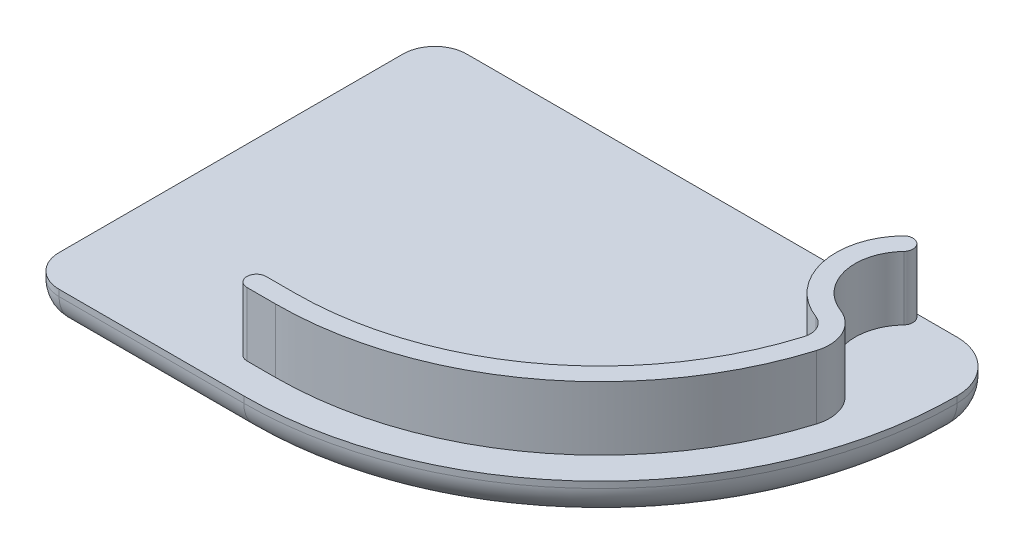
ISO-10303-21;
HEADER;
FILE_DESCRIPTION(('STEP AP214'),'2;1');
FILE_NAME('part.step','',(''),(''),'','','');
FILE_SCHEMA(('AUTOMOTIVE_DESIGN { 1 0 10303 214 1 1 1 1 }'));
ENDSEC;
DATA;
#1=APPLICATION_CONTEXT('core data for automotive mechanical design processes');
#2=APPLICATION_PROTOCOL_DEFINITION('international standard','automotive_design',2000,#1);
#3=PRODUCT_CONTEXT('',#1,'mechanical');
#4=PRODUCT('Part','Part','',(#3));
#5=PRODUCT_RELATED_PRODUCT_CATEGORY('part','',(#4));
#6=PRODUCT_DEFINITION_FORMATION('','',#4);
#7=PRODUCT_DEFINITION_CONTEXT('part definition',#1,'design');
#8=PRODUCT_DEFINITION('design','',#6,#7);
#9=PRODUCT_DEFINITION_SHAPE('','',#8);
#10=(LENGTH_UNIT() NAMED_UNIT(*) SI_UNIT(.MILLI.,.METRE.));
#11=(NAMED_UNIT(*) PLANE_ANGLE_UNIT() SI_UNIT($,.RADIAN.));
#12=(NAMED_UNIT(*) SI_UNIT($,.STERADIAN.) SOLID_ANGLE_UNIT());
#13=UNCERTAINTY_MEASURE_WITH_UNIT(LENGTH_MEASURE(1.E-05),#10,'distance_accuracy_value','');
#14=(GEOMETRIC_REPRESENTATION_CONTEXT(3) GLOBAL_UNCERTAINTY_ASSIGNED_CONTEXT((#13)) GLOBAL_UNIT_ASSIGNED_CONTEXT((#10,
#11,#12)) REPRESENTATION_CONTEXT('',''));
#15=CARTESIAN_POINT('',(0.,0.,0.));
#16=DIRECTION('',(0.,0.,1.));
#17=DIRECTION('',(1.,0.,0.));
#18=AXIS2_PLACEMENT_3D('',#15,#16,#17);
#19=CARTESIAN_POINT('',(40.9999973497516,-2.99999999999999,4.00000043020666));
#20=DIRECTION('',(0.,1.,0.));
#21=DIRECTION('',(0.,0.,1.));
#22=AXIS2_PLACEMENT_3D('',#19,#20,#21);
#23=CYLINDRICAL_SURFACE('',#22,4.00000074290213);
#24=CARTESIAN_POINT('',(40.9999973497516,0.,4.00000043020666));
#25=DIRECTION('',(0.,1.,0.));
#26=DIRECTION('',(0.,0.,1.));
#27=AXIS2_PLACEMENT_3D('',#24,#25,#26);
#28=CIRCLE('',#27,4.00000074290213);
#29=CARTESIAN_POINT('',(44.9999980926524,0.,3.99999813701283));
#30=VERTEX_POINT('',#29);
#31=CARTESIAN_POINT('',(41.0015789831232,0.,0.));
#32=VERTEX_POINT('',#31);
#33=EDGE_CURVE('E358',#30,#32,#28,.T.);
#34=ORIENTED_EDGE('',*,*,#33,.F.);
#35=DIRECTION('',(0.,1.,0.));
#36=VECTOR('',#35,1.);
#37=CARTESIAN_POINT('',(44.999998092651,-2.99999999999999,3.99999577211788));
#38=LINE('',#37,#36);
#39=CARTESIAN_POINT('',(44.9999980926516,-0.499999999999989,3.99999649994411));
#40=VERTEX_POINT('',#39);
#41=EDGE_CURVE('E271',#30,#40,#38,.F.);
#42=ORIENTED_EDGE('',*,*,#41,.T.);
#43=CARTESIAN_POINT('',(40.9999973497516,-0.49999999999999,4.00000043020666));
#44=DIRECTION('',(0.,1.,0.));
#45=DIRECTION('',(0.,0.,1.));
#46=AXIS2_PLACEMENT_3D('',#43,#44,#45);
#47=CIRCLE('',#46,4.00000074290213);
#48=CARTESIAN_POINT('',(41.0015789831232,-0.49999999999999,0.));
#49=VERTEX_POINT('',#48);
#50=EDGE_CURVE('E263',#40,#49,#47,.T.);
#51=ORIENTED_EDGE('',*,*,#50,.T.);
#52=DIRECTION('',(0.,1.,0.));
#53=VECTOR('',#52,1.);
#54=CARTESIAN_POINT('',(41.0015789831232,-2.99999999999999,0.));
#55=LINE('',#54,#53);
#56=EDGE_CURVE('E270',#49,#32,#55,.T.);
#57=ORIENTED_EDGE('',*,*,#56,.T.);
#58=EDGE_LOOP('',(#34,#42,#51,#57));
#59=FACE_BOUND('',#58,.T.);
#60=ADVANCED_FACE('F16',(#59),#23,.T.);
#61=CARTESIAN_POINT('',(17.,-3.,3.99999999999998));
#62=DIRECTION('',(0.,1.,0.));
#63=DIRECTION('',(0.,0.,1.));
#64=AXIS2_PLACEMENT_3D('',#61,#62,#63);
#65=CYLINDRICAL_SURFACE('',#64,27.9999980926514);
#66=CARTESIAN_POINT('',(17.,0.,3.99999999999998));
#67=DIRECTION('',(0.,1.,0.));
#68=DIRECTION('',(0.,0.,1.));
#69=AXIS2_PLACEMENT_3D('',#66,#67,#68);
#70=CIRCLE('',#69,27.9999980926514);
#71=CARTESIAN_POINT('',(17.,0.,31.9999980926514));
#72=VERTEX_POINT('',#71);
#73=EDGE_CURVE('E361',#72,#30,#70,.T.);
#74=ORIENTED_EDGE('',*,*,#73,.F.);
#75=DIRECTION('',(0.,1.,0.));
#76=VECTOR('',#75,1.);
#77=CARTESIAN_POINT('',(17.,-2.99999999999999,31.9999980926514));
#78=LINE('',#77,#76);
#79=CARTESIAN_POINT('',(17.,-0.499999999999989,31.9999980926514));
#80=VERTEX_POINT('',#79);
#81=EDGE_CURVE('E276',#72,#80,#78,.F.);
#82=ORIENTED_EDGE('',*,*,#81,.T.);
#83=CARTESIAN_POINT('',(17.,-0.499999999999995,3.99999999999998));
#84=DIRECTION('',(0.,1.,0.));
#85=DIRECTION('',(0.,0.,1.));
#86=AXIS2_PLACEMENT_3D('',#83,#84,#85);
#87=CIRCLE('',#86,27.9999980926514);
#88=EDGE_CURVE('E272',#80,#40,#87,.T.);
#89=ORIENTED_EDGE('',*,*,#88,.T.);
#90=ORIENTED_EDGE('',*,*,#41,.F.);
#91=EDGE_LOOP('',(#74,#82,#89,#90));
#92=FACE_BOUND('',#91,.T.);
#93=ADVANCED_FACE('F454',(#92),#65,.T.);
#94=CARTESIAN_POINT('',(17.,-2.99999999999999,31.9999980926514));
#95=DIRECTION('',(0.,0.,1.));
#96=DIRECTION('',(1.,0.,0.));
#97=AXIS2_PLACEMENT_3D('',#94,#95,#96);
#98=PLANE('',#97);
#99=CARTESIAN_POINT('',(2.49999999999999,0.,31.9999980926514));
#100=CARTESIAN_POINT('',(17.,0.,31.9999980926514));
#101=B_SPLINE_CURVE_WITH_KNOTS('',1,(#99,#100),.UNSPECIFIED.,.F.,.F.,(2,2),(0.,1.),.UNSPECIFIED.);
#102=CARTESIAN_POINT('',(2.49999999999999,0.,31.9999980926514));
#103=VERTEX_POINT('',#102);
#104=EDGE_CURVE('E364',#103,#72,#101,.T.);
#105=ORIENTED_EDGE('',*,*,#104,.F.);
#106=DIRECTION('',(0.,1.,0.));
#107=VECTOR('',#106,1.);
#108=CARTESIAN_POINT('',(2.49999999999999,-2.99999999999999,31.9999980926514));
#109=LINE('',#108,#107);
#110=CARTESIAN_POINT('',(2.49999999999999,-0.499999999999991,31.9999980926514));
#111=VERTEX_POINT('',#110);
#112=EDGE_CURVE('E275',#103,#111,#109,.F.);
#113=ORIENTED_EDGE('',*,*,#112,.T.);
#114=DIRECTION('',(1.,0.,0.));
#115=VECTOR('',#114,1.);
#116=CARTESIAN_POINT('',(17.,-0.499999999999991,31.9999980926514));
#117=LINE('',#116,#115);
#118=EDGE_CURVE('E277',#111,#80,#117,.T.);
#119=ORIENTED_EDGE('',*,*,#118,.T.);
#120=ORIENTED_EDGE('',*,*,#81,.F.);
#121=EDGE_LOOP('',(#105,#113,#119,#120));
#122=FACE_BOUND('',#121,.T.);
#123=ADVANCED_FACE('F458',(#122),#98,.T.);
#124=CARTESIAN_POINT('',(2.49999999999999,-2.99999999999999,29.4999980926514));
#125=DIRECTION('',(0.,1.,0.));
#126=DIRECTION('',(0.,0.,1.));
#127=AXIS2_PLACEMENT_3D('',#124,#125,#126);
#128=CYLINDRICAL_SURFACE('',#127,2.5);
#129=CARTESIAN_POINT('',(2.49999999999998,0.,29.4999980926514));
#130=DIRECTION('',(0.,1.,0.));
#131=DIRECTION('',(0.,0.,1.));
#132=AXIS2_PLACEMENT_3D('',#129,#130,#131);
#133=CIRCLE('',#132,2.5);
#134=CARTESIAN_POINT('',(0.,0.,29.4999980926514));
#135=VERTEX_POINT('',#134);
#136=EDGE_CURVE('E365',#135,#103,#133,.T.);
#137=ORIENTED_EDGE('',*,*,#136,.F.);
#138=DIRECTION('',(0.,1.,0.));
#139=VECTOR('',#138,1.);
#140=CARTESIAN_POINT('',(0.,-2.99999999999999,29.4999980926514));
#141=LINE('',#140,#139);
#142=CARTESIAN_POINT('',(0.,-0.499999999999994,29.4999980926514));
#143=VERTEX_POINT('',#142);
#144=EDGE_CURVE('E280',#135,#143,#141,.F.);
#145=ORIENTED_EDGE('',*,*,#144,.T.);
#146=CARTESIAN_POINT('',(2.49999999999999,-0.499999999999991,29.4999980926514));
#147=DIRECTION('',(0.,1.,0.));
#148=DIRECTION('',(0.,0.,1.));
#149=AXIS2_PLACEMENT_3D('',#146,#147,#148);
#150=CIRCLE('',#149,2.5);
#151=EDGE_CURVE('E281',#143,#111,#150,.T.);
#152=ORIENTED_EDGE('',*,*,#151,.T.);
#153=ORIENTED_EDGE('',*,*,#112,.F.);
#154=EDGE_LOOP('',(#137,#145,#152,#153));
#155=FACE_BOUND('',#154,.T.);
#156=ADVANCED_FACE('F463',(#155),#128,.T.);
#157=CARTESIAN_POINT('',(0.,-2.99999999999999,29.4999980926514));
#158=DIRECTION('',(-1.,0.,0.));
#159=DIRECTION('',(0.,0.,1.));
#160=AXIS2_PLACEMENT_3D('',#157,#158,#159);
#161=PLANE('',#160);
#162=CARTESIAN_POINT('',(0.,0.,2.5));
#163=CARTESIAN_POINT('',(0.,0.,29.4999980926514));
#164=B_SPLINE_CURVE_WITH_KNOTS('',1,(#162,#163),.UNSPECIFIED.,.F.,.F.,(2,2),(0.,1.),.UNSPECIFIED.);
#165=CARTESIAN_POINT('',(0.,0.,2.49999999999999));
#166=VERTEX_POINT('',#165);
#167=EDGE_CURVE('E368',#166,#135,#164,.T.);
#168=ORIENTED_EDGE('',*,*,#167,.F.);
#169=DIRECTION('',(0.,1.,0.));
#170=VECTOR('',#169,1.);
#171=CARTESIAN_POINT('',(0.,-2.99999999999999,2.49999999999999));
#172=LINE('',#171,#170);
#173=CARTESIAN_POINT('',(0.,-0.499999999999999,2.49999999999999));
#174=VERTEX_POINT('',#173);
#175=EDGE_CURVE('E284',#166,#174,#172,.F.);
#176=ORIENTED_EDGE('',*,*,#175,.T.);
#177=DIRECTION('',(0.,0.,1.));
#178=VECTOR('',#177,1.);
#179=CARTESIAN_POINT('',(0.,-0.499999999999999,29.4999980926514));
#180=LINE('',#179,#178);
#181=EDGE_CURVE('E285',#174,#143,#180,.T.);
#182=ORIENTED_EDGE('',*,*,#181,.T.);
#183=ORIENTED_EDGE('',*,*,#144,.F.);
#184=EDGE_LOOP('',(#168,#176,#182,#183));
#185=FACE_BOUND('',#184,.T.);
#186=ADVANCED_FACE('F476',(#185),#161,.T.);
#187=CARTESIAN_POINT('',(2.5,-3.,2.5));
#188=DIRECTION('',(0.,1.,0.));
#189=DIRECTION('',(0.,0.,1.));
#190=AXIS2_PLACEMENT_3D('',#187,#188,#189);
#191=CYLINDRICAL_SURFACE('',#190,2.50000000000001);
#192=CARTESIAN_POINT('',(2.5,0.,2.5));
#193=DIRECTION('',(0.,1.,0.));
#194=DIRECTION('',(0.,0.,1.));
#195=AXIS2_PLACEMENT_3D('',#192,#193,#194);
#196=CIRCLE('',#195,2.50000000000001);
#197=CARTESIAN_POINT('',(2.49999999999999,0.,0.));
#198=VERTEX_POINT('',#197);
#199=EDGE_CURVE('E369',#198,#166,#196,.T.);
#200=ORIENTED_EDGE('',*,*,#199,.F.);
#201=DIRECTION('',(0.,1.,0.));
#202=VECTOR('',#201,1.);
#203=CARTESIAN_POINT('',(2.49999999999999,-3.,0.));
#204=LINE('',#203,#202);
#205=CARTESIAN_POINT('',(2.49999999999999,-0.500000000007663,0.));
#206=VERTEX_POINT('',#205);
#207=EDGE_CURVE('E288',#198,#206,#204,.F.);
#208=ORIENTED_EDGE('',*,*,#207,.T.);
#209=CARTESIAN_POINT('',(2.5,-0.499999999999999,2.5));
#210=DIRECTION('',(0.,1.,0.));
#211=DIRECTION('',(0.,0.,1.));
#212=AXIS2_PLACEMENT_3D('',#209,#210,#211);
#213=CIRCLE('',#212,2.50000000000001);
#214=EDGE_CURVE('E289',#206,#174,#213,.T.);
#215=ORIENTED_EDGE('',*,*,#214,.T.);
#216=ORIENTED_EDGE('',*,*,#175,.F.);
#217=EDGE_LOOP('',(#200,#208,#215,#216));
#218=FACE_BOUND('',#217,.T.);
#219=ADVANCED_FACE('F474',(#218),#191,.T.);
#220=CARTESIAN_POINT('',(2.49999999999999,-3.,0.));
#221=DIRECTION('',(0.,0.,-1.));
#222=DIRECTION('',(-1.,0.,0.));
#223=AXIS2_PLACEMENT_3D('',#220,#221,#222);
#224=PLANE('',#223);
#225=CARTESIAN_POINT('',(2.49999999999999,0.,0.));
#226=CARTESIAN_POINT('',(41.0015789831232,0.,0.));
#227=B_SPLINE_CURVE_WITH_KNOTS('',1,(#225,#226),.UNSPECIFIED.,.F.,.F.,(2,2),(0.,1.),.UNSPECIFIED.);
#228=CARTESIAN_POINT('',(37.5358909166095,0.,2.76380782219783E-06));
#229=VERTEX_POINT('',#228);
#230=EDGE_CURVE('E372',#198,#229,#227,.T.);
#231=ORIENTED_EDGE('',*,*,#230,.T.);
#232=EDGE_CURVE('E357',#229,#32,#227,.T.);
#233=ORIENTED_EDGE('',*,*,#232,.T.);
#234=ORIENTED_EDGE('',*,*,#56,.F.);
#235=DIRECTION('',(-1.,0.,0.));
#236=VECTOR('',#235,1.);
#237=CARTESIAN_POINT('',(2.49999999999999,-0.49999999999999,0.));
#238=LINE('',#237,#236);
#239=EDGE_CURVE('E292',#49,#206,#238,.T.);
#240=ORIENTED_EDGE('',*,*,#239,.T.);
#241=ORIENTED_EDGE('',*,*,#207,.F.);
#242=EDGE_LOOP('',(#231,#233,#234,#240,#241));
#243=FACE_BOUND('',#242,.T.);
#244=ADVANCED_FACE('F444',(#243),#224,.T.);
#245=CARTESIAN_POINT('',(9.89063707631696,-0.499999999999997,2.5));
#246=DIRECTION('',(-1.,0.,0.));
#247=DIRECTION('',(0.,0.,1.));
#248=AXIS2_PLACEMENT_3D('',#245,#246,#247);
#249=CYLINDRICAL_SURFACE('',#248,2.5);
#250=DIRECTION('',(-1.,0.,0.));
#251=VECTOR('',#250,1.);
#252=CARTESIAN_POINT('',(9.89063707631696,-3.,2.49999999999999));
#253=LINE('',#252,#251);
#254=CARTESIAN_POINT('',(41.0015789831232,-2.99999999999999,2.5));
#255=VERTEX_POINT('',#254);
#256=CARTESIAN_POINT('',(2.49999999999999,-3.,2.49999999999999));
#257=VERTEX_POINT('',#256);
#258=EDGE_CURVE('E295',#255,#257,#253,.T.);
#259=ORIENTED_EDGE('',*,*,#258,.T.);
#260=CARTESIAN_POINT('',(2.49999999999999,-0.499999999999998,2.49999999999999));
#261=DIRECTION('',(-1.,0.,0.));
#262=DIRECTION('',(0.,0.,1.));
#263=AXIS2_PLACEMENT_3D('',#260,#261,#262);
#264=CIRCLE('',#263,2.5);
#265=EDGE_CURVE('E297',#206,#257,#264,.T.);
#266=ORIENTED_EDGE('',*,*,#265,.F.);
#267=ORIENTED_EDGE('',*,*,#239,.F.);
#268=CARTESIAN_POINT('',(41.0015789831232,-0.49999999999999,2.50000000000001));
#269=DIRECTION('',(-1.,0.,0.));
#270=DIRECTION('',(0.,0.,1.));
#271=AXIS2_PLACEMENT_3D('',#268,#269,#270);
#272=CIRCLE('',#271,2.5);
#273=EDGE_CURVE('E300',#255,#49,#272,.F.);
#274=ORIENTED_EDGE('',*,*,#273,.F.);
#275=EDGE_LOOP('',(#259,#266,#267,#274));
#276=FACE_BOUND('',#275,.T.);
#277=ADVANCED_FACE('F229',(#276),#249,.T.);
#278=CARTESIAN_POINT('',(2.49999999999998,-0.499999999999998,2.49999999999999));
#279=DIRECTION('',(-1.,0.,0.));
#280=DIRECTION('',(0.,0.,1.));
#281=AXIS2_PLACEMENT_3D('',#278,#279,#280);
#282=SPHERICAL_SURFACE('',#281,2.5);
#283=ORIENTED_EDGE('',*,*,#265,.T.);
#284=CARTESIAN_POINT('',(2.49999999999999,-0.499999999999999,2.49999999999999));
#285=DIRECTION('',(0.,0.,1.));
#286=DIRECTION('',(0.,-1.,0.));
#287=AXIS2_PLACEMENT_3D('',#284,#285,#286);
#288=CIRCLE('',#287,2.5);
#289=EDGE_CURVE('E303',#174,#257,#288,.T.);
#290=ORIENTED_EDGE('',*,*,#289,.F.);
#291=ORIENTED_EDGE('',*,*,#214,.F.);
#292=EDGE_LOOP('',(#283,#290,#291));
#293=FACE_BOUND('',#292,.T.);
#294=ADVANCED_FACE('F224',(#293),#282,.T.);
#295=CARTESIAN_POINT('',(2.49999999999999,-0.499999999999994,21.8850492987137));
#296=DIRECTION('',(0.,0.,1.));
#297=DIRECTION('',(0.,-1.,0.));
#298=AXIS2_PLACEMENT_3D('',#295,#296,#297);
#299=CYLINDRICAL_SURFACE('',#298,2.5);
#300=DIRECTION('',(0.,0.,1.));
#301=VECTOR('',#300,1.);
#302=CARTESIAN_POINT('',(2.49999999999999,-2.99999999999999,21.8850492987137));
#303=LINE('',#302,#301);
#304=CARTESIAN_POINT('',(2.49999999999999,-2.99999999999999,29.4999980926514));
#305=VERTEX_POINT('',#304);
#306=EDGE_CURVE('E306',#257,#305,#303,.T.);
#307=ORIENTED_EDGE('',*,*,#306,.T.);
#308=CARTESIAN_POINT('',(2.49999999999999,-0.499999999999994,29.4999980926514));
#309=DIRECTION('',(0.,0.,1.));
#310=DIRECTION('',(-1.,0.,0.));
#311=AXIS2_PLACEMENT_3D('',#308,#309,#310);
#312=CIRCLE('',#311,2.5);
#313=EDGE_CURVE('E308',#143,#305,#312,.T.);
#314=ORIENTED_EDGE('',*,*,#313,.F.);
#315=ORIENTED_EDGE('',*,*,#181,.F.);
#316=ORIENTED_EDGE('',*,*,#289,.T.);
#317=EDGE_LOOP('',(#307,#314,#315,#316));
#318=FACE_BOUND('',#317,.T.);
#319=ADVANCED_FACE('F228',(#318),#299,.T.);
#320=CARTESIAN_POINT('',(2.49999999999999,-0.499999999999992,29.4999980926514));
#321=DIRECTION('',(-1.,0.,0.));
#322=DIRECTION('',(0.,0.,1.));
#323=AXIS2_PLACEMENT_3D('',#320,#321,#322);
#324=SPHERICAL_SURFACE('',#323,2.5);
#325=ORIENTED_EDGE('',*,*,#313,.T.);
#326=CARTESIAN_POINT('',(2.49999999999999,-0.499999999999992,29.4999980926514));
#327=DIRECTION('',(1.,0.,0.));
#328=DIRECTION('',(0.,0.,-1.));
#329=AXIS2_PLACEMENT_3D('',#326,#327,#328);
#330=CIRCLE('',#329,2.5);
#331=EDGE_CURVE('E311',#111,#305,#330,.T.);
#332=ORIENTED_EDGE('',*,*,#331,.F.);
#333=ORIENTED_EDGE('',*,*,#151,.F.);
#334=EDGE_LOOP('',(#325,#332,#333));
#335=FACE_BOUND('',#334,.T.);
#336=ADVANCED_FACE('F234',(#335),#324,.T.);
#337=CARTESIAN_POINT('',(17.140637076317,-0.499999999999989,29.4999980926514));
#338=DIRECTION('',(1.,0.,0.));
#339=DIRECTION('',(0.,0.,-1.));
#340=AXIS2_PLACEMENT_3D('',#337,#338,#339);
#341=CYLINDRICAL_SURFACE('',#340,2.5);
#342=ORIENTED_EDGE('',*,*,#118,.F.);
#343=ORIENTED_EDGE('',*,*,#331,.T.);
#344=DIRECTION('',(1.,0.,0.));
#345=VECTOR('',#344,1.);
#346=CARTESIAN_POINT('',(17.140637076317,-2.99999999999999,29.4999980926514));
#347=LINE('',#346,#345);
#348=CARTESIAN_POINT('',(17.,-2.99999999999999,29.4999980926514));
#349=VERTEX_POINT('',#348);
#350=EDGE_CURVE('E144',#305,#349,#347,.T.);
#351=ORIENTED_EDGE('',*,*,#350,.T.);
#352=CARTESIAN_POINT('',(17.,-0.499999999999989,29.4999980926514));
#353=DIRECTION('',(1.,0.,0.));
#354=DIRECTION('',(0.,0.,1.));
#355=AXIS2_PLACEMENT_3D('',#352,#353,#354);
#356=CIRCLE('',#355,2.5);
#357=EDGE_CURVE('E314',#80,#349,#356,.T.);
#358=ORIENTED_EDGE('',*,*,#357,.F.);
#359=EDGE_LOOP('',(#342,#343,#351,#358));
#360=FACE_BOUND('',#359,.T.);
#361=ADVANCED_FACE('F238',(#360),#341,.T.);
#362=CARTESIAN_POINT('',(17.,-0.499999999999995,3.99999999999998));
#363=DIRECTION('',(0.,1.,0.));
#364=DIRECTION('',(-1.,0.,0.));
#365=AXIS2_PLACEMENT_3D('',#362,#363,#364);
#366=TOROIDAL_SURFACE('',#365,25.4999980926514,2.5);
#367=ORIENTED_EDGE('',*,*,#88,.F.);
#368=ORIENTED_EDGE('',*,*,#357,.T.);
#369=CARTESIAN_POINT('',(17.,-2.99999999999999,3.99999999999998));
#370=DIRECTION('',(0.,1.,0.));
#371=DIRECTION('',(0.,0.,1.));
#372=AXIS2_PLACEMENT_3D('',#369,#370,#371);
#373=CIRCLE('',#372,25.4999980926514);
#374=CARTESIAN_POINT('',(42.4999980926528,-2.99999999999999,3.99999933846664));
#375=VERTEX_POINT('',#374);
#376=EDGE_CURVE('E151',#349,#375,#373,.T.);
#377=ORIENTED_EDGE('',*,*,#376,.T.);
#378=CARTESIAN_POINT('',(42.4999980926536,-0.499999999999996,3.99999977516252));
#379=DIRECTION('',(-4.36695878980666E-07,0.,-0.999999999999905));
#380=DIRECTION('',(-0.999999999999905,0.,4.36695878980666E-07));
#381=AXIS2_PLACEMENT_3D('',#378,#379,#380);
#382=CIRCLE('',#381,2.49999999999999);
#383=EDGE_CURVE('E320',#40,#375,#382,.T.);
#384=ORIENTED_EDGE('',*,*,#383,.F.);
#385=EDGE_LOOP('',(#367,#368,#377,#384));
#386=FACE_BOUND('',#385,.T.);
#387=ADVANCED_FACE('F242',(#386),#366,.T.);
#388=CARTESIAN_POINT('',(40.9999973497516,-0.499999999999993,4.00000043020666));
#389=DIRECTION('',(0.,-1.,0.));
#390=DIRECTION('',(0.,0.,-1.));
#391=AXIS2_PLACEMENT_3D('',#388,#389,#390);
#392=DEGENERATE_TOROIDAL_SURFACE('',#391,1.50000074290213,2.5,.T.);
#393=ORIENTED_EDGE('',*,*,#50,.F.);
#394=ORIENTED_EDGE('',*,*,#383,.T.);
#395=CARTESIAN_POINT('',(42.4999980926527,-2.99999999999999,3.99999868342283));
#396=CARTESIAN_POINT('',(42.4999847617985,-2.99999999997347,3.9811684441104));
#397=CARTESIAN_POINT('',(42.4996207525742,-2.99999999989954,3.96233840083435));
#398=CARTESIAN_POINT('',(42.4981920280898,-2.99999999978626,3.9247051257822));
#399=CARTESIAN_POINT('',(42.4971273205423,-2.99999999974691,3.90590189371327));
#400=CARTESIAN_POINT('',(42.4942978428481,-2.99999999983216,3.86834815263613));
#401=CARTESIAN_POINT('',(42.4925330692642,-2.99999999995676,3.84959764388723));
#402=CARTESIAN_POINT('',(42.4883090482433,-2.99999999997311,3.81217442541329));
#403=CARTESIAN_POINT('',(42.4858497863434,-2.99999999986486,3.79350171731669));
#404=CARTESIAN_POINT('',(42.4802282564035,-2.99999999978529,3.75626209373122));
#405=CARTESIAN_POINT('',(42.4770659625364,-2.99999999981398,3.73769518215467));
#406=CARTESIAN_POINT('',(42.4710839508499,-2.9999999969731,3.70597092157346));
#407=CARTESIAN_POINT('',(42.4684244251404,-2.99999999492912,3.69278338159164));
#408=CARTESIAN_POINT('',(42.4653998391962,-2.99999999501781,3.6789524287656));
#409=CARTESIAN_POINT('',(42.4652482705546,-2.99999999502811,3.67826216137791));
#410=CARTESIAN_POINT('',(42.4628083145393,-2.99999999522546,3.66719007727529));
#411=CARTESIAN_POINT('',(42.4604026833204,-2.99999999586284,3.65683404613386));
#412=CARTESIAN_POINT('',(42.4523723625492,-2.99999999757,3.62384632510908));
#413=CARTESIAN_POINT('',(42.4463322133126,-2.99999999824802,3.60131423662036));
#414=CARTESIAN_POINT('',(42.4344129557004,-2.9999999992705,3.56068266208358));
#415=CARTESIAN_POINT('',(42.4287092663601,-2.9999999996534,3.54253146373911));
#416=CARTESIAN_POINT('',(42.4200301921507,-2.99999999990516,3.51663051665881));
#417=CARTESIAN_POINT('',(42.4173301589715,-2.99999999994213,3.50878761569904));
#418=CARTESIAN_POINT('',(42.4080405189759,-3.00000000002244,3.48249611086417));
#419=CARTESIAN_POINT('',(42.4011611489246,-3.00000000000586,3.46414884478718));
#420=CARTESIAN_POINT('',(42.3865806586031,-2.99999999994055,3.42742337737555));
#421=CARTESIAN_POINT('',(42.378867589665,-2.99999999989128,3.40904991935151));
#422=CARTESIAN_POINT('',(42.3673019736812,-2.99999999898403,3.38293427440039));
#423=CARTESIAN_POINT('',(42.3637367429005,-2.99999999859982,3.3750638495519));
#424=CARTESIAN_POINT('',(42.3552064041945,-2.99999999741116,3.35665627743747));
#425=CARTESIAN_POINT('',(42.3501860631853,-2.99999999650698,3.3461446677224));
#426=CARTESIAN_POINT('',(42.3360407339192,-2.99999999388148,3.31740396583823));
#427=CARTESIAN_POINT('',(42.3266611629055,-2.99999999205589,3.29929945032711));
#428=CARTESIAN_POINT('',(42.3071650151343,-2.99999998870592,3.26349142844535));
#429=CARTESIAN_POINT('',(42.297048410453,-2.99999998718155,3.24578793730148));
#430=CARTESIAN_POINT('',(42.2760945749841,-2.99999998491619,3.21081198750257));
#431=CARTESIAN_POINT('',(42.2652573289495,-2.99999998417522,3.19353953797783));
#432=CARTESIAN_POINT('',(42.2428808252238,-2.99999998366551,3.15945549468587));
#433=CARTESIAN_POINT('',(42.2313415644278,-2.99999998389677,3.14264390295738));
#434=CARTESIAN_POINT('',(42.2075813188918,-2.99999998527737,3.10950976726393));
#435=CARTESIAN_POINT('',(42.1953603425505,-2.99999998642668,3.09318721727774));
#436=CARTESIAN_POINT('',(42.1702553785624,-2.99999998930955,3.06106126645419));
#437=CARTESIAN_POINT('',(42.1573714101916,-2.99999999104308,3.04525785054512));
#438=CARTESIAN_POINT('',(42.1309709439638,-2.99999999457703,3.01418914080987));
#439=CARTESIAN_POINT('',(42.1174544751035,-2.99999999637745,2.99892382237085));
#440=CARTESIAN_POINT('',(42.0897809098389,-2.99999999899629,2.96898746238465));
#441=CARTESIAN_POINT('',(42.0756238535546,-2.99999999981476,2.95431638372879));
#442=CARTESIAN_POINT('',(42.0542767834364,-3.00000000008921,2.93295345595523));
#443=CARTESIAN_POINT('',(42.0472790148486,-3.0000000000315,2.92606730841192));
#444=CARTESIAN_POINT('',(42.0229109113744,-2.99999999953718,2.90255199762063));
#445=CARTESIAN_POINT('',(42.0052057130769,-2.99999999867263,2.88626590619576));
#446=CARTESIAN_POINT('',(41.9740662101981,-2.99999999548124,2.85896949900006));
#447=CARTESIAN_POINT('',(41.9608130642489,-2.99999999362778,2.84775126583634));
#448=CARTESIAN_POINT('',(41.9386881340895,-2.99999999001934,2.8296758215064));
#449=CARTESIAN_POINT('',(41.9299278388664,-2.99999998846216,2.82268182132075));
#450=CARTESIAN_POINT('',(41.9046686363271,-2.99999998415122,2.80298147630135));
#451=CARTESIAN_POINT('',(41.887976839179,-2.99999998151669,2.79052079577052));
#452=CARTESIAN_POINT('',(41.8558103267632,-2.99999997848229,2.76755532896245));
#453=CARTESIAN_POINT('',(41.8403852957491,-2.99999997788176,2.75698072667319));
#454=CARTESIAN_POINT('',(41.8076981501898,-2.9999999782935,2.73547396174921));
#455=CARTESIAN_POINT('',(41.7903981442979,-2.99999997946018,2.72459929561662));
#456=CARTESIAN_POINT('',(41.7553663134968,-2.99999998232598,2.70357066197162));
#457=CARTESIAN_POINT('',(41.7376344980779,-2.99999998402509,2.69341667863904));
#458=CARTESIAN_POINT('',(41.7017678271808,-2.99999998788092,2.67384889145167));
#459=CARTESIAN_POINT('',(41.683632986457,-2.99999999003762,2.66443506055738));
#460=CARTESIAN_POINT('',(41.6469923017412,-2.99999999414324,2.64636188308961));
#461=CARTESIAN_POINT('',(41.6284864767703,-2.99999999609217,2.63770249795523));
#462=CARTESIAN_POINT('',(41.5911333672825,-2.99999999901227,2.62115790209605));
#463=CARTESIAN_POINT('',(41.5722861052917,-2.99999999998351,2.61327264051767));
#464=CARTESIAN_POINT('',(41.535792329436,-3.00000000001513,2.59886474825558));
#465=CARTESIAN_POINT('',(41.5181688362784,-2.99999999922065,2.59228366514328));
#466=CARTESIAN_POINT('',(41.4826949093545,-2.99999999818015,2.57976691723424));
#467=CARTESIAN_POINT('',(41.4648444834718,-2.9999999979341,2.57383123008471));
#468=CARTESIAN_POINT('',(41.4289388219939,-2.99999999807959,2.56261363463112));
#469=CARTESIAN_POINT('',(41.4108835848261,-2.99999999847114,2.55733173135056));
#470=CARTESIAN_POINT('',(41.3745896215867,-3.00000000021333,2.5474412860595));
#471=CARTESIAN_POINT('',(41.3563508863835,-3.00000000156401,2.54283277773871));
#472=CARTESIAN_POINT('',(41.3197223984726,-2.99999999755862,2.53424340923355));
#473=CARTESIAN_POINT('',(41.3013326319761,-2.99999999220192,2.53026260704352));
#474=CARTESIAN_POINT('',(41.2738799675525,-2.99999999034308,2.52496057656154));
#475=CARTESIAN_POINT('',(41.2648775844769,-2.9999999907063,2.52332344454904));
#476=CARTESIAN_POINT('',(41.2342074608287,-2.99999999239431,2.51803930371854));
#477=CARTESIAN_POINT('',(41.2124695310456,-2.99999999435328,2.51479066118488));
#478=CARTESIAN_POINT('',(41.1750025473806,-2.99999999697525,2.51003386589537));
#479=CARTESIAN_POINT('',(41.1593023871826,-2.99999999784776,2.50829316453894));
#480=CARTESIAN_POINT('',(41.1315064808439,-2.99999999899138,2.50565395937692));
#481=CARTESIAN_POINT('',(41.1194203149733,-2.99999999935509,2.50465375021309));
#482=CARTESIAN_POINT('',(41.0870900014001,-2.99999999998364,2.50236896786445));
#483=CARTESIAN_POINT('',(41.0668267867184,-3.00000000001743,2.50134565898169));
#484=CARTESIAN_POINT('',(41.0315648841673,-2.99999999998646,2.50026388316844));
#485=CARTESIAN_POINT('',(41.0165715686979,-2.9999999999451,2.50002337731482));
#486=CARTESIAN_POINT('',(41.0015789831232,-2.99999999999994,2.50000000000001));
#487=B_SPLINE_CURVE_WITH_KNOTS('',3,(#395,#396,#397,#398,#399,#400,#401,#402,#403,#404,#405,
#406,#407,#408,#409,#410,#411,#412,#413,#414,#415,#416,#417,#418,#419,#420,#421,#422,#423,#424,
#425,#426,#427,#428,#429,#430,#431,#432,#433,#434,#435,#436,#437,#438,#439,#440,#441,#442,#443,
#444,#445,#446,#447,#448,#449,#450,#451,#452,#453,#454,#455,#456,#457,#458,#459,#460,#461,#462,
#463,#464,#465,#466,#467,#468,#469,#470,#471,#472,#473,#474,#475,#476,#477,#478,#479,#480,#481,
#482,#483,#484,#485,#486),.UNSPECIFIED.,.F.,.F.,(4,2,2,2,2,2,2,2,2,2,2,2,2,2,2,2,2,2,2,2,2,2,2,
2,2,2,2,2,2,2,2,2,2,2,2,2,2,2,2,2,2,2,2,2,2,4),(0.,0.0564875740771048,0.112974526412908,
0.169461756102516,0.225950162240545,0.282440643920191,0.322793899041873,0.324914035370157,
0.356807125129289,0.426762135972304,0.483826599551401,0.50870986839796,0.567478085701372,
0.6272420710197,0.653161933974571,0.688105752813095,0.749257036559752,0.810410638323075,
0.87156553434203,0.932720700854318,0.993875114097445,1.05502775030979,1.11617758573164,
1.1773235966063,1.20677616978685,1.27891284319612,1.33099372834663,1.36462071294921,
1.42708962129438,1.4831819887084,1.54446612298909,1.60574891156697,1.66702946030019,
1.72830687504903,1.78958026167658,1.84600430469265,1.90242639288283,1.95884891457899,
2.01527425810785,2.07170481177402,2.09915351393195,2.16506678482644,2.21244846034264,
2.24882782564179,2.30967739735884,2.35465596460075),.UNSPECIFIED.);
#488=EDGE_CURVE('E322',#375,#255,#487,.T.);
#489=ORIENTED_EDGE('',*,*,#488,.T.);
#490=ORIENTED_EDGE('',*,*,#273,.T.);
#491=EDGE_LOOP('',(#393,#394,#489,#490));
#492=FACE_BOUND('',#491,.T.);
#493=ADVANCED_FACE('F245',(#492),#392,.T.);
#494=CARTESIAN_POINT('',(17.2812741526339,-2.99999999999999,14.270100504776));
#495=DIRECTION('',(0.,1.,0.));
#496=DIRECTION('',(0.,0.,1.));
#497=AXIS2_PLACEMENT_3D('',#494,#495,#496);
#498=PLANE('',#497);
#499=ORIENTED_EDGE('',*,*,#306,.F.);
#500=ORIENTED_EDGE('',*,*,#258,.F.);
#501=ORIENTED_EDGE('',*,*,#488,.F.);
#502=ORIENTED_EDGE('',*,*,#376,.F.);
#503=ORIENTED_EDGE('',*,*,#350,.F.);
#504=EDGE_LOOP('',(#499,#500,#501,#502,#503));
#505=FACE_BOUND('',#504,.T.);
#506=ADVANCED_FACE('F18',(#505),#498,.F.);
#507=CARTESIAN_POINT('',(14.7499973497517,0.,28.7500004301873));
#508=DIRECTION('',(0.,1.,0.));
#509=DIRECTION('',(0.,0.,1.));
#510=AXIS2_PLACEMENT_3D('',#507,#508,#509);
#511=CYLINDRICAL_SURFACE('',#510,0.750000000019403);
#512=CARTESIAN_POINT('',(14.7499973497517,0.,28.7500004301873));
#513=DIRECTION('',(0.,1.,0.));
#514=DIRECTION('',(0.,0.,1.));
#515=AXIS2_PLACEMENT_3D('',#512,#513,#514);
#516=CIRCLE('',#515,0.750000000019403);
#517=CARTESIAN_POINT('',(14.7500032625324,0.,28.0000004302067));
#518=VERTEX_POINT('',#517);
#519=CARTESIAN_POINT('',(14.7499973497517,0.,29.5000004302067));
#520=VERTEX_POINT('',#519);
#521=EDGE_CURVE('E382',#518,#520,#516,.T.);
#522=ORIENTED_EDGE('',*,*,#521,.T.);
#523=DIRECTION('',(0.,1.,0.));
#524=VECTOR('',#523,1.);
#525=CARTESIAN_POINT('',(14.7499973497517,0.,29.5000004302067));
#526=LINE('',#525,#524);
#527=CARTESIAN_POINT('',(14.7499973497517,5.00000000000001,29.5000004302067));
#528=VERTEX_POINT('',#527);
#529=EDGE_CURVE('E160',#520,#528,#526,.T.);
#530=ORIENTED_EDGE('',*,*,#529,.T.);
#531=CARTESIAN_POINT('',(14.7499973497517,5.00000000000001,28.7500004301873));
#532=DIRECTION('',(0.,1.,0.));
#533=DIRECTION('',(0.,0.,1.));
#534=AXIS2_PLACEMENT_3D('',#531,#532,#533);
#535=CIRCLE('',#534,0.750000000019403);
#536=CARTESIAN_POINT('',(14.7500015459186,5.00000000000001,28.0000004302067));
#537=VERTEX_POINT('',#536);
#538=EDGE_CURVE('E349',#528,#537,#535,.F.);
#539=ORIENTED_EDGE('',*,*,#538,.T.);
#540=DIRECTION('',(0.,1.,0.));
#541=VECTOR('',#540,1.);
#542=CARTESIAN_POINT('',(14.7500049791461,0.,28.0000004302067));
#543=LINE('',#542,#541);
#544=EDGE_CURVE('E345',#537,#518,#543,.F.);
#545=ORIENTED_EDGE('',*,*,#544,.T.);
#546=EDGE_LOOP('',(#522,#530,#539,#545));
#547=FACE_BOUND('',#546,.T.);
#548=ADVANCED_FACE('F441',(#547),#511,.T.);
#549=CARTESIAN_POINT('',(16.9999973497516,0.,29.5000004302067));
#550=DIRECTION('',(0.,0.,1.));
#551=DIRECTION('',(1.,0.,0.));
#552=AXIS2_PLACEMENT_3D('',#549,#550,#551);
#553=PLANE('',#552);
#554=CARTESIAN_POINT('',(14.7499973497517,0.,29.5000004302067));
#555=CARTESIAN_POINT('',(16.9999973497516,0.,29.5000004302067));
#556=B_SPLINE_CURVE_WITH_KNOTS('',1,(#554,#555),.UNSPECIFIED.,.F.,.F.,(2,2),(0.,1.),.UNSPECIFIED.);
#557=CARTESIAN_POINT('',(16.9999973497516,0.,29.5000004302067));
#558=VERTEX_POINT('',#557);
#559=EDGE_CURVE('E383',#520,#558,#556,.T.);
#560=ORIENTED_EDGE('',*,*,#559,.T.);
#561=DIRECTION('',(0.,1.,0.));
#562=VECTOR('',#561,1.);
#563=CARTESIAN_POINT('',(16.9999973497516,0.,29.5000004302067));
#564=LINE('',#563,#562);
#565=CARTESIAN_POINT('',(16.9999973497516,5.00000000000001,29.5000004302067));
#566=VERTEX_POINT('',#565);
#567=EDGE_CURVE('E348',#558,#566,#564,.T.);
#568=ORIENTED_EDGE('',*,*,#567,.T.);
#569=DIRECTION('',(1.,0.,0.));
#570=VECTOR('',#569,1.);
#571=CARTESIAN_POINT('',(16.9999973497516,5.00000000000001,29.5000004302067));
#572=LINE('',#571,#570);
#573=EDGE_CURVE('E352',#566,#528,#572,.F.);
#574=ORIENTED_EDGE('',*,*,#573,.T.);
#575=ORIENTED_EDGE('',*,*,#529,.F.);
#576=EDGE_LOOP('',(#560,#568,#574,#575));
#577=FACE_BOUND('',#576,.T.);
#578=ADVANCED_FACE('F495',(#577),#553,.T.);
#579=CARTESIAN_POINT('',(16.9999973497516,0.,4.00000043020666));
#580=DIRECTION('',(0.,1.,0.));
#581=DIRECTION('',(0.,0.,1.));
#582=AXIS2_PLACEMENT_3D('',#579,#580,#581);
#583=CYLINDRICAL_SURFACE('',#582,25.5);
#584=CARTESIAN_POINT('',(16.9999973497516,0.,4.00000043020666));
#585=DIRECTION('',(0.,1.,0.));
#586=DIRECTION('',(0.,0.,1.));
#587=AXIS2_PLACEMENT_3D('',#584,#585,#586);
#588=CIRCLE('',#587,25.5);
#589=CARTESIAN_POINT('',(41.3961777767225,0.,11.4213467079841));
#590=VERTEX_POINT('',#589);
#591=EDGE_CURVE('E95',#558,#590,#588,.T.);
#592=ORIENTED_EDGE('',*,*,#591,.T.);
#593=DIRECTION('',(0.,1.,0.));
#594=VECTOR('',#593,1.);
#595=CARTESIAN_POINT('',(41.3961777767225,0.,11.4213467079841));
#596=LINE('',#595,#594);
#597=CARTESIAN_POINT('',(41.3961777767225,5.00000000000001,11.4213467079841));
#598=VERTEX_POINT('',#597);
#599=EDGE_CURVE('E353',#590,#598,#596,.T.);
#600=ORIENTED_EDGE('',*,*,#599,.T.);
#601=CARTESIAN_POINT('',(16.9999973497516,5.00000000000001,4.00000043020666));
#602=DIRECTION('',(0.,1.,0.));
#603=DIRECTION('',(0.,0.,1.));
#604=AXIS2_PLACEMENT_3D('',#601,#602,#603);
#605=CIRCLE('',#604,25.5);
#606=EDGE_CURVE('E218',#598,#566,#605,.F.);
#607=ORIENTED_EDGE('',*,*,#606,.T.);
#608=ORIENTED_EDGE('',*,*,#567,.F.);
#609=EDGE_LOOP('',(#592,#600,#607,#608));
#610=FACE_BOUND('',#609,.T.);
#611=ADVANCED_FACE('F498',(#610),#583,.T.);
#612=CARTESIAN_POINT('',(38.5260173809175,0.,10.5482574150122));
#613=DIRECTION('',(0.,1.,0.));
#614=DIRECTION('',(0.,0.,1.));
#615=AXIS2_PLACEMENT_3D('',#612,#613,#614);
#616=CYLINDRICAL_SURFACE('',#615,3.00001760180661);
#617=CARTESIAN_POINT('',(38.5260173809175,0.,10.5482574150122));
#618=DIRECTION('',(0.,1.,0.));
#619=DIRECTION('',(0.,0.,1.));
#620=AXIS2_PLACEMENT_3D('',#617,#618,#619);
#621=CIRCLE('',#620,3.00001760180661);
#622=CARTESIAN_POINT('',(39.586303299709,0.,7.74185413295508));
#623=VERTEX_POINT('',#622);
#624=EDGE_CURVE('E21',#590,#623,#621,.T.);
#625=ORIENTED_EDGE('',*,*,#624,.T.);
#626=DIRECTION('',(0.,1.,0.));
#627=VECTOR('',#626,1.);
#628=CARTESIAN_POINT('',(39.5863067893613,0.,7.74185545137776));
#629=LINE('',#628,#627);
#630=CARTESIAN_POINT('',(39.586303299709,5.00000000000001,7.74185413295508));
#631=VERTEX_POINT('',#630);
#632=EDGE_CURVE('E216',#623,#631,#629,.T.);
#633=ORIENTED_EDGE('',*,*,#632,.T.);
#634=CARTESIAN_POINT('',(38.5260173809175,5.00000000000001,10.5482574150122));
#635=DIRECTION('',(0.,1.,0.));
#636=DIRECTION('',(0.,0.,1.));
#637=AXIS2_PLACEMENT_3D('',#634,#635,#636);
#638=CIRCLE('',#637,3.00001760180661);
#639=EDGE_CURVE('E215',#631,#598,#638,.F.);
#640=ORIENTED_EDGE('',*,*,#639,.T.);
#641=ORIENTED_EDGE('',*,*,#599,.F.);
#642=EDGE_LOOP('',(#625,#633,#640,#641));
#643=FACE_BOUND('',#642,.T.);
#644=ADVANCED_FACE('F501',(#643),#616,.T.);
#645=CARTESIAN_POINT('',(40.9999973497516,0.,4.00000043020667));
#646=DIRECTION('',(0.,1.,0.));
#647=DIRECTION('',(0.,0.,1.));
#648=AXIS2_PLACEMENT_3D('',#645,#646,#647);
#649=CYLINDRICAL_SURFACE('',#648,4.);
#650=ORIENTED_EDGE('',*,*,#632,.F.);
#651=CARTESIAN_POINT('',(40.9999973497516,0.,4.00000043020667));
#652=DIRECTION('',(0.,1.,0.));
#653=DIRECTION('',(0.,0.,1.));
#654=AXIS2_PLACEMENT_3D('',#651,#652,#653);
#655=CIRCLE('',#654,4.);
#656=CARTESIAN_POINT('',(38.0828574483075,0.,1.26316013611003));
#657=VERTEX_POINT('',#656);
#658=EDGE_CURVE('E10',#657,#623,#655,.T.);
#659=ORIENTED_EDGE('',*,*,#658,.F.);
#660=DIRECTION('',(0.,1.,0.));
#661=VECTOR('',#660,1.);
#662=CARTESIAN_POINT('',(38.0828597763669,0.,1.26315765468099));
#663=LINE('',#662,#661);
#664=CARTESIAN_POINT('',(38.0828574483209,5.00000000000001,1.26316013612257));
#665=VERTEX_POINT('',#664);
#666=EDGE_CURVE('E212',#665,#657,#663,.F.);
#667=ORIENTED_EDGE('',*,*,#666,.F.);
#668=CARTESIAN_POINT('',(40.9999973497516,5.00000000000001,4.00000043020667));
#669=DIRECTION('',(0.,1.,0.));
#670=DIRECTION('',(0.,0.,1.));
#671=AXIS2_PLACEMENT_3D('',#668,#669,#670);
#672=CIRCLE('',#671,4.);
#673=EDGE_CURVE('E214',#631,#665,#672,.F.);
#674=ORIENTED_EDGE('',*,*,#673,.F.);
#675=EDGE_LOOP('',(#650,#659,#667,#674));
#676=FACE_BOUND('',#675,.T.);
#677=ADVANCED_FACE('F504',(#676),#649,.F.);
#678=CARTESIAN_POINT('',(37.5358909522112,0.,0.750005527659176));
#679=DIRECTION('',(0.,1.,0.));
#680=DIRECTION('',(0.,0.,1.));
#681=AXIS2_PLACEMENT_3D('',#678,#679,#680);
#682=CYLINDRICAL_SURFACE('',#681,0.75000000004354);
#683=CARTESIAN_POINT('',(37.5358909522112,0.,0.750005527659176));
#684=DIRECTION('',(0.,1.,0.));
#685=DIRECTION('',(0.,0.,1.));
#686=AXIS2_PLACEMENT_3D('',#683,#684,#685);
#687=CIRCLE('',#686,0.75000000004354);
#688=CARTESIAN_POINT('',(36.9889306254675,0.,0.236844343416999));
#689=VERTEX_POINT('',#688);
#690=EDGE_CURVE('E373',#229,#689,#687,.T.);
#691=ORIENTED_EDGE('',*,*,#690,.T.);
#692=DIRECTION('',(0.,1.,0.));
#693=VECTOR('',#692,1.);
#694=CARTESIAN_POINT('',(36.9889331863476,0.,0.236841613858859));
#695=LINE('',#694,#693);
#696=CARTESIAN_POINT('',(36.9889306254675,5.00000000000001,0.236844343416998));
#697=VERTEX_POINT('',#696);
#698=EDGE_CURVE('E343',#689,#697,#695,.T.);
#699=ORIENTED_EDGE('',*,*,#698,.T.);
#700=CARTESIAN_POINT('',(37.5358909522112,5.00000000000001,0.750005527659175));
#701=DIRECTION('',(0.,1.,0.));
#702=DIRECTION('',(0.,0.,1.));
#703=AXIS2_PLACEMENT_3D('',#700,#701,#702);
#704=CIRCLE('',#703,0.75000000004354);
#705=EDGE_CURVE('E189',#697,#665,#704,.F.);
#706=ORIENTED_EDGE('',*,*,#705,.T.);
#707=ORIENTED_EDGE('',*,*,#666,.T.);
#708=CARTESIAN_POINT('',(37.5358909522112,0.,0.750005527659176));
#709=DIRECTION('',(0.,1.,0.));
#710=DIRECTION('',(0.,0.,1.));
#711=AXIS2_PLACEMENT_3D('',#708,#709,#710);
#712=CIRCLE('',#711,0.75000000004354);
#713=EDGE_CURVE('E26',#657,#229,#712,.T.);
#714=ORIENTED_EDGE('',*,*,#713,.T.);
#715=EDGE_LOOP('',(#691,#699,#706,#707,#714));
#716=FACE_BOUND('',#715,.T.);
#717=ADVANCED_FACE('F428',(#716),#682,.T.);
#718=CARTESIAN_POINT('',(40.9999973497516,0.,4.00000043020666));
#719=DIRECTION('',(0.,1.,0.));
#720=DIRECTION('',(0.,0.,1.));
#721=AXIS2_PLACEMENT_3D('',#718,#719,#720);
#722=CYLINDRICAL_SURFACE('',#721,5.5);
#723=CARTESIAN_POINT('',(40.9999973497516,0.,4.00000043020666));
#724=DIRECTION('',(0.,1.,0.));
#725=DIRECTION('',(0.,0.,1.));
#726=AXIS2_PLACEMENT_3D('',#723,#724,#725);
#727=CIRCLE('',#726,5.5);
#728=CARTESIAN_POINT('',(39.0561728292149,0.,9.14505108431691));
#729=VERTEX_POINT('',#728);
#730=EDGE_CURVE('E185',#689,#729,#727,.T.);
#731=ORIENTED_EDGE('',*,*,#730,.T.);
#732=DIRECTION('',(0.,1.,0.));
#733=VECTOR('',#732,1.);
#734=CARTESIAN_POINT('',(39.0561728292149,0.,9.14505108431691));
#735=LINE('',#734,#733);
#736=CARTESIAN_POINT('',(39.0561728292149,5.00000000000001,9.14505108431691));
#737=VERTEX_POINT('',#736);
#738=EDGE_CURVE('E179',#729,#737,#735,.T.);
#739=ORIENTED_EDGE('',*,*,#738,.T.);
#740=CARTESIAN_POINT('',(40.9999973497516,5.00000000000001,4.00000043020666));
#741=DIRECTION('',(0.,1.,0.));
#742=DIRECTION('',(0.,0.,1.));
#743=AXIS2_PLACEMENT_3D('',#740,#741,#742);
#744=CIRCLE('',#743,5.5);
#745=EDGE_CURVE('E183',#737,#697,#744,.F.);
#746=ORIENTED_EDGE('',*,*,#745,.T.);
#747=ORIENTED_EDGE('',*,*,#698,.F.);
#748=EDGE_LOOP('',(#731,#739,#746,#747));
#749=FACE_BOUND('',#748,.T.);
#750=ADVANCED_FACE('F181',(#749),#722,.T.);
#751=CARTESIAN_POINT('',(38.526017380764,0.,10.5482574150868));
#752=DIRECTION('',(0.,1.,0.));
#753=DIRECTION('',(0.,0.,1.));
#754=AXIS2_PLACEMENT_3D('',#751,#752,#753);
#755=CYLINDRICAL_SURFACE('',#754,1.50001760197497);
#756=ORIENTED_EDGE('',*,*,#738,.F.);
#757=CARTESIAN_POINT('',(38.526017380764,0.,10.5482574150868));
#758=DIRECTION('',(0.,1.,0.));
#759=DIRECTION('',(0.,0.,1.));
#760=AXIS2_PLACEMENT_3D('',#757,#758,#759);
#761=CIRCLE('',#760,1.50001760197497);
#762=CARTESIAN_POINT('',(39.9611083398419,0.,10.9847969269384));
#763=VERTEX_POINT('',#762);
#764=EDGE_CURVE('E376',#763,#729,#761,.T.);
#765=ORIENTED_EDGE('',*,*,#764,.F.);
#766=DIRECTION('',(0.,1.,0.));
#767=VECTOR('',#766,1.);
#768=CARTESIAN_POINT('',(39.9611083398419,0.,10.9847969269384));
#769=LINE('',#768,#767);
#770=CARTESIAN_POINT('',(39.9611083398419,5.00000000000001,10.9847969269384));
#771=VERTEX_POINT('',#770);
#772=EDGE_CURVE('E198',#771,#763,#769,.F.);
#773=ORIENTED_EDGE('',*,*,#772,.F.);
#774=CARTESIAN_POINT('',(38.526017380764,5.00000000000001,10.5482574150867));
#775=DIRECTION('',(0.,1.,0.));
#776=DIRECTION('',(0.,0.,1.));
#777=AXIS2_PLACEMENT_3D('',#774,#775,#776);
#778=CIRCLE('',#777,1.50001760197497);
#779=EDGE_CURVE('E195',#737,#771,#778,.F.);
#780=ORIENTED_EDGE('',*,*,#779,.F.);
#781=EDGE_LOOP('',(#756,#765,#773,#780));
#782=FACE_BOUND('',#781,.T.);
#783=ADVANCED_FACE('F200',(#782),#755,.F.);
#784=CARTESIAN_POINT('',(16.9999973497516,0.,4.00000043020667));
#785=DIRECTION('',(0.,1.,0.));
#786=DIRECTION('',(0.,0.,1.));
#787=AXIS2_PLACEMENT_3D('',#784,#785,#786);
#788=CYLINDRICAL_SURFACE('',#787,24.);
#789=ORIENTED_EDGE('',*,*,#772,.T.);
#790=CARTESIAN_POINT('',(16.9999973497516,0.,4.00000043020667));
#791=DIRECTION('',(0.,1.,0.));
#792=DIRECTION('',(0.,0.,1.));
#793=AXIS2_PLACEMENT_3D('',#790,#791,#792);
#794=CIRCLE('',#793,24.);
#795=CARTESIAN_POINT('',(16.9999973497516,0.,28.0000004302067));
#796=VERTEX_POINT('',#795);
#797=EDGE_CURVE('E378',#796,#763,#794,.T.);
#798=ORIENTED_EDGE('',*,*,#797,.F.);
#799=DIRECTION('',(0.,1.,0.));
#800=VECTOR('',#799,1.);
#801=CARTESIAN_POINT('',(16.9999973497516,0.,28.0000004302067));
#802=LINE('',#801,#800);
#803=CARTESIAN_POINT('',(16.9999973497516,5.00000000000001,28.0000004302067));
#804=VERTEX_POINT('',#803);
#805=EDGE_CURVE('E102',#804,#796,#802,.F.);
#806=ORIENTED_EDGE('',*,*,#805,.F.);
#807=CARTESIAN_POINT('',(16.9999973497516,5.00000000000001,4.00000043020667));
#808=DIRECTION('',(0.,1.,0.));
#809=DIRECTION('',(0.,0.,1.));
#810=AXIS2_PLACEMENT_3D('',#807,#808,#809);
#811=CIRCLE('',#810,24.);
#812=EDGE_CURVE('E203',#771,#804,#811,.F.);
#813=ORIENTED_EDGE('',*,*,#812,.F.);
#814=EDGE_LOOP('',(#789,#798,#806,#813));
#815=FACE_BOUND('',#814,.T.);
#816=ADVANCED_FACE('F435',(#815),#788,.F.);
#817=CARTESIAN_POINT('',(14.7500049791461,0.,28.0000004302067));
#818=DIRECTION('',(0.,0.,-1.));
#819=DIRECTION('',(-1.,0.,0.));
#820=AXIS2_PLACEMENT_3D('',#817,#818,#819);
#821=PLANE('',#820);
#822=CARTESIAN_POINT('',(14.7500015459186,0.,28.0000004302067));
#823=CARTESIAN_POINT('',(16.9999973497516,0.,28.0000004302067));
#824=B_SPLINE_CURVE_WITH_KNOTS('',1,(#822,#823),.UNSPECIFIED.,.F.,.F.,(2,2),(0.,1.),.UNSPECIFIED.);
#825=EDGE_CURVE('E381',#518,#796,#824,.T.);
#826=ORIENTED_EDGE('',*,*,#825,.F.);
#827=ORIENTED_EDGE('',*,*,#544,.F.);
#828=DIRECTION('',(-1.,0.,0.));
#829=VECTOR('',#828,1.);
#830=CARTESIAN_POINT('',(14.7500049791461,5.00000000000001,28.0000004302067));
#831=LINE('',#830,#829);
#832=EDGE_CURVE('E209',#537,#804,#831,.F.);
#833=ORIENTED_EDGE('',*,*,#832,.T.);
#834=ORIENTED_EDGE('',*,*,#805,.T.);
#835=EDGE_LOOP('',(#826,#827,#833,#834));
#836=FACE_BOUND('',#835,.T.);
#837=ADVANCED_FACE('F439',(#836),#821,.T.);
#838=CARTESIAN_POINT('',(14.7500049791461,5.00000000000001,28.0000004302067));
#839=DIRECTION('',(0.,1.,0.));
#840=DIRECTION('',(0.,0.,1.));
#841=AXIS2_PLACEMENT_3D('',#838,#839,#840);
#842=PLANE('',#841);
#843=ORIENTED_EDGE('',*,*,#779,.T.);
#844=ORIENTED_EDGE('',*,*,#812,.T.);
#845=ORIENTED_EDGE('',*,*,#832,.F.);
#846=ORIENTED_EDGE('',*,*,#538,.F.);
#847=ORIENTED_EDGE('',*,*,#573,.F.);
#848=ORIENTED_EDGE('',*,*,#606,.F.);
#849=ORIENTED_EDGE('',*,*,#639,.F.);
#850=ORIENTED_EDGE('',*,*,#673,.T.);
#851=ORIENTED_EDGE('',*,*,#705,.F.);
#852=ORIENTED_EDGE('',*,*,#745,.F.);
#853=EDGE_LOOP('',(#843,#844,#845,#846,#847,#848,#849,#850,#851,#852));
#854=FACE_BOUND('',#853,.T.);
#855=ADVANCED_FACE('F194',(#854),#842,.T.);
#856=CARTESIAN_POINT('',(2.49999999999999,0.,0.));
#857=DIRECTION('',(0.,1.,0.));
#858=DIRECTION('',(0.,0.,1.));
#859=AXIS2_PLACEMENT_3D('',#856,#857,#858);
#860=PLANE('',#859);
#861=ORIENTED_EDGE('',*,*,#624,.F.);
#862=ORIENTED_EDGE('',*,*,#591,.F.);
#863=ORIENTED_EDGE('',*,*,#559,.F.);
#864=ORIENTED_EDGE('',*,*,#521,.F.);
#865=ORIENTED_EDGE('',*,*,#825,.T.);
#866=ORIENTED_EDGE('',*,*,#797,.T.);
#867=ORIENTED_EDGE('',*,*,#764,.T.);
#868=ORIENTED_EDGE('',*,*,#730,.F.);
#869=ORIENTED_EDGE('',*,*,#690,.F.);
#870=ORIENTED_EDGE('',*,*,#230,.F.);
#871=ORIENTED_EDGE('',*,*,#199,.T.);
#872=ORIENTED_EDGE('',*,*,#167,.T.);
#873=ORIENTED_EDGE('',*,*,#136,.T.);
#874=ORIENTED_EDGE('',*,*,#104,.T.);
#875=ORIENTED_EDGE('',*,*,#73,.T.);
#876=ORIENTED_EDGE('',*,*,#33,.T.);
#877=ORIENTED_EDGE('',*,*,#232,.F.);
#878=ORIENTED_EDGE('',*,*,#713,.F.);
#879=ORIENTED_EDGE('',*,*,#658,.T.);
#880=EDGE_LOOP('',(#861,#862,#863,#864,#865,#866,#867,#868,#869,#870,#871,#872,#873,#874,#875,
#876,#877,#878,#879));
#881=FACE_BOUND('',#880,.T.);
#882=ADVANCED_FACE('F432',(#881),#860,.T.);
#883=CLOSED_SHELL('',(#60,#93,#123,#156,#186,#219,#244,#277,#294,#319,#336,#361,#387,#493,#506,
#548,#578,#611,#644,#677,#717,#750,#783,#816,#837,#855,#882));
#884=MANIFOLD_SOLID_BREP('B1',#883);
#885=ADVANCED_BREP_SHAPE_REPRESENTATION('',(#18,#884),#14);
#886=SHAPE_DEFINITION_REPRESENTATION(#9,#885);
ENDSEC;
END-ISO-10303-21;
